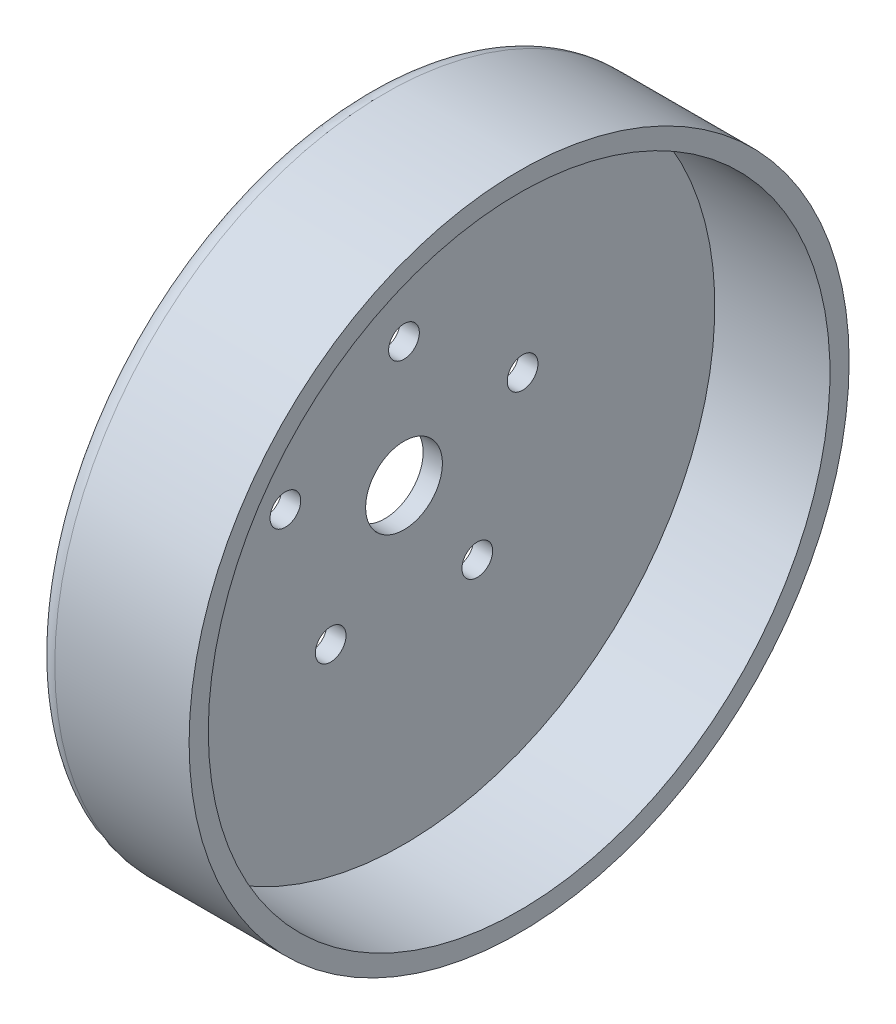
ISO-10303-21;
HEADER;
FILE_DESCRIPTION(('STEP AP214'),'2;1');
FILE_NAME('part.step','',(''),(''),'','','');
FILE_SCHEMA(('AUTOMOTIVE_DESIGN { 1 0 10303 214 1 1 1 1 }'));
ENDSEC;
DATA;
#1=APPLICATION_CONTEXT('core data for automotive mechanical design processes');
#2=APPLICATION_PROTOCOL_DEFINITION('international standard','automotive_design',2000,#1);
#3=PRODUCT_CONTEXT('',#1,'mechanical');
#4=PRODUCT('Part','Part','',(#3));
#5=PRODUCT_RELATED_PRODUCT_CATEGORY('part','',(#4));
#6=PRODUCT_DEFINITION_FORMATION('','',#4);
#7=PRODUCT_DEFINITION_CONTEXT('part definition',#1,'design');
#8=PRODUCT_DEFINITION('design','',#6,#7);
#9=PRODUCT_DEFINITION_SHAPE('','',#8);
#10=(LENGTH_UNIT() NAMED_UNIT(*) SI_UNIT(.MILLI.,.METRE.));
#11=(NAMED_UNIT(*) PLANE_ANGLE_UNIT() SI_UNIT($,.RADIAN.));
#12=(NAMED_UNIT(*) SI_UNIT($,.STERADIAN.) SOLID_ANGLE_UNIT());
#13=UNCERTAINTY_MEASURE_WITH_UNIT(LENGTH_MEASURE(1.E-05),#10,'distance_accuracy_value','');
#14=(GEOMETRIC_REPRESENTATION_CONTEXT(3) GLOBAL_UNCERTAINTY_ASSIGNED_CONTEXT((#13)) GLOBAL_UNIT_ASSIGNED_CONTEXT((#10,
#11,#12)) REPRESENTATION_CONTEXT('',''));
#15=CARTESIAN_POINT('',(0.,0.,0.));
#16=DIRECTION('',(0.,0.,1.));
#17=DIRECTION('',(1.,0.,0.));
#18=AXIS2_PLACEMENT_3D('',#15,#16,#17);
#19=CARTESIAN_POINT('',(0.,0.,0.));
#20=DIRECTION('',(-1.,0.,0.));
#21=DIRECTION('',(0.,0.,1.));
#22=AXIS2_PLACEMENT_3D('',#19,#20,#21);
#23=PLANE('',#22);
#24=CARTESIAN_POINT('',(0.,-26.293052317185,19.1030206995079));
#25=DIRECTION('',(-1.,0.,0.));
#26=DIRECTION('',(0.,0.,1.));
#27=AXIS2_PLACEMENT_3D('',#24,#25,#26);
#28=CIRCLE('',#27,4.00000000000234);
#29=CARTESIAN_POINT('',(0.,-26.293052317185,23.1030206995102));
#30=VERTEX_POINT('',#29);
#31=EDGE_CURVE('E86',#30,#30,#28,.F.);
#32=ORIENTED_EDGE('',*,*,#31,.F.);
#33=EDGE_LOOP('',(#32));
#34=FACE_BOUND('',#33,.T.);
#35=CARTESIAN_POINT('',(0.,10.0430523171871,30.9093367795934));
#36=DIRECTION('',(-1.,0.,0.));
#37=DIRECTION('',(0.,0.,1.));
#38=AXIS2_PLACEMENT_3D('',#35,#36,#37);
#39=CIRCLE('',#38,4.00000000000063);
#40=CARTESIAN_POINT('',(0.,10.0430523171871,34.9093367795941));
#41=VERTEX_POINT('',#40);
#42=EDGE_CURVE('E80',#41,#41,#39,.F.);
#43=ORIENTED_EDGE('',*,*,#42,.F.);
#44=EDGE_LOOP('',(#43));
#45=FACE_BOUND('',#44,.T.);
#46=CARTESIAN_POINT('',(0.,32.5,0.));
#47=DIRECTION('',(-1.,0.,0.));
#48=DIRECTION('',(0.,0.,1.));
#49=AXIS2_PLACEMENT_3D('',#46,#47,#48);
#50=CIRCLE('',#49,4.);
#51=CARTESIAN_POINT('',(0.,32.5,4.));
#52=VERTEX_POINT('',#51);
#53=EDGE_CURVE('E73',#52,#52,#50,.F.);
#54=ORIENTED_EDGE('',*,*,#53,.F.);
#55=EDGE_LOOP('',(#54));
#56=FACE_BOUND('',#55,.T.);
#57=CARTESIAN_POINT('',(0.,10.0430523171845,-30.9093367795915));
#58=DIRECTION('',(-1.,0.,0.));
#59=DIRECTION('',(0.,0.,1.));
#60=AXIS2_PLACEMENT_3D('',#57,#58,#59);
#61=CIRCLE('',#60,4.00000000000166);
#62=CARTESIAN_POINT('',(0.,10.0430523171845,-26.9093367795899));
#63=VERTEX_POINT('',#62);
#64=EDGE_CURVE('E74',#63,#63,#61,.F.);
#65=ORIENTED_EDGE('',*,*,#64,.F.);
#66=EDGE_LOOP('',(#65));
#67=FACE_BOUND('',#66,.T.);
#68=CARTESIAN_POINT('',(0.,-26.2930523171866,-19.1030206995029));
#69=DIRECTION('',(-1.,0.,0.));
#70=DIRECTION('',(0.,0.,1.));
#71=AXIS2_PLACEMENT_3D('',#68,#69,#70);
#72=CIRCLE('',#71,4.0000000000029);
#73=CARTESIAN_POINT('',(0.,-26.2930523171866,-15.1030206995));
#74=VERTEX_POINT('',#73);
#75=EDGE_CURVE('E63',#74,#74,#72,.F.);
#76=ORIENTED_EDGE('',*,*,#75,.F.);
#77=EDGE_LOOP('',(#76));
#78=FACE_BOUND('',#77,.T.);
#79=CARTESIAN_POINT('',(0.,0.,0.));
#80=DIRECTION('',(-1.,0.,0.));
#81=DIRECTION('',(0.,0.,1.));
#82=AXIS2_PLACEMENT_3D('',#79,#80,#81);
#83=CIRCLE('',#82,10.);
#84=CARTESIAN_POINT('',(0.,0.,10.));
#85=VERTEX_POINT('',#84);
#86=EDGE_CURVE('E58',#85,#85,#83,.T.);
#87=ORIENTED_EDGE('',*,*,#86,.T.);
#88=EDGE_LOOP('',(#87));
#89=FACE_BOUND('',#88,.T.);
#90=CARTESIAN_POINT('',(0.,0.,0.));
#91=DIRECTION('',(-1.,0.,0.));
#92=DIRECTION('',(0.,0.,1.));
#93=AXIS2_PLACEMENT_3D('',#90,#91,#92);
#94=CIRCLE('',#93,81.);
#95=CARTESIAN_POINT('',(0.,0.,81.));
#96=VERTEX_POINT('',#95);
#97=EDGE_CURVE('E43',#96,#96,#94,.T.);
#98=ORIENTED_EDGE('',*,*,#97,.F.);
#99=EDGE_LOOP('',(#98));
#100=FACE_BOUND('',#99,.T.);
#101=ADVANCED_FACE('F31',(#34,#45,#56,#67,#78,#89,#100),#23,.F.);
#102=CARTESIAN_POINT('',(-10.,0.,0.));
#103=DIRECTION('',(-1.,0.,0.));
#104=DIRECTION('',(0.,0.,1.));
#105=AXIS2_PLACEMENT_3D('',#102,#103,#104);
#106=CYLINDRICAL_SURFACE('',#105,81.);
#107=CARTESIAN_POINT('',(30.,0.,0.));
#108=DIRECTION('',(-1.,0.,0.));
#109=DIRECTION('',(0.,0.,1.));
#110=AXIS2_PLACEMENT_3D('',#107,#108,#109);
#111=CIRCLE('',#110,81.);
#112=CARTESIAN_POINT('',(30.,0.,81.));
#113=VERTEX_POINT('',#112);
#114=EDGE_CURVE('E48',#113,#113,#111,.T.);
#115=ORIENTED_EDGE('',*,*,#114,.F.);
#116=EDGE_LOOP('',(#115));
#117=FACE_BOUND('',#116,.T.);
#118=ORIENTED_EDGE('',*,*,#97,.T.);
#119=EDGE_LOOP('',(#118));
#120=FACE_BOUND('',#119,.T.);
#121=ADVANCED_FACE('F98',(#117,#120),#106,.F.);
#122=CARTESIAN_POINT('',(30.,81.,0.));
#123=DIRECTION('',(-1.,0.,0.));
#124=DIRECTION('',(0.,0.,1.));
#125=AXIS2_PLACEMENT_3D('',#122,#123,#124);
#126=PLANE('',#125);
#127=CARTESIAN_POINT('',(30.,0.,0.));
#128=DIRECTION('',(-1.,0.,0.));
#129=DIRECTION('',(0.,0.,1.));
#130=AXIS2_PLACEMENT_3D('',#127,#128,#129);
#131=CIRCLE('',#130,86.);
#132=CARTESIAN_POINT('',(30.,0.,86.));
#133=VERTEX_POINT('',#132);
#134=EDGE_CURVE('E51',#133,#133,#131,.T.);
#135=ORIENTED_EDGE('',*,*,#134,.F.);
#136=EDGE_LOOP('',(#135));
#137=FACE_BOUND('',#136,.T.);
#138=ORIENTED_EDGE('',*,*,#114,.T.);
#139=EDGE_LOOP('',(#138));
#140=FACE_BOUND('',#139,.T.);
#141=ADVANCED_FACE('F112',(#137,#140),#126,.F.);
#142=CARTESIAN_POINT('',(-10.,0.,0.));
#143=DIRECTION('',(-1.,0.,0.));
#144=DIRECTION('',(0.,0.,1.));
#145=AXIS2_PLACEMENT_3D('',#142,#143,#144);
#146=CYLINDRICAL_SURFACE('',#145,86.);
#147=CARTESIAN_POINT('',(-5.00000000000001,0.,0.));
#148=DIRECTION('',(1.,0.,0.));
#149=DIRECTION('',(0.,0.,-1.));
#150=AXIS2_PLACEMENT_3D('',#147,#148,#149);
#151=CIRCLE('',#150,86.);
#152=CARTESIAN_POINT('',(-5.00000000000001,0.,-86.));
#153=VERTEX_POINT('',#152);
#154=EDGE_CURVE('E10',#153,#153,#151,.T.);
#155=ORIENTED_EDGE('',*,*,#154,.T.);
#156=EDGE_LOOP('',(#155));
#157=FACE_BOUND('',#156,.T.);
#158=ORIENTED_EDGE('',*,*,#134,.T.);
#159=EDGE_LOOP('',(#158));
#160=FACE_BOUND('',#159,.T.);
#161=ADVANCED_FACE('F119',(#157,#160),#146,.T.);
#162=CARTESIAN_POINT('',(-10.,86.,0.));
#163=DIRECTION('',(1.,0.,0.));
#164=DIRECTION('',(0.,0.,-1.));
#165=AXIS2_PLACEMENT_3D('',#162,#163,#164);
#166=PLANE('',#165);
#167=CARTESIAN_POINT('',(-10.,0.,0.));
#168=DIRECTION('',(-1.,0.,0.));
#169=DIRECTION('',(0.,0.,1.));
#170=AXIS2_PLACEMENT_3D('',#167,#168,#169);
#171=CIRCLE('',#170,45.);
#172=CARTESIAN_POINT('',(-10.,0.,45.));
#173=VERTEX_POINT('',#172);
#174=EDGE_CURVE('E55',#173,#173,#171,.T.);
#175=ORIENTED_EDGE('',*,*,#174,.F.);
#176=EDGE_LOOP('',(#175));
#177=FACE_BOUND('',#176,.T.);
#178=CARTESIAN_POINT('',(-10.,0.,0.));
#179=DIRECTION('',(1.,0.,0.));
#180=DIRECTION('',(0.,0.,-1.));
#181=AXIS2_PLACEMENT_3D('',#178,#179,#180);
#182=CIRCLE('',#181,81.);
#183=CARTESIAN_POINT('',(-10.,0.,-81.));
#184=VERTEX_POINT('',#183);
#185=EDGE_CURVE('E39',#184,#184,#182,.F.);
#186=ORIENTED_EDGE('',*,*,#185,.T.);
#187=EDGE_LOOP('',(#186));
#188=FACE_BOUND('',#187,.T.);
#189=ADVANCED_FACE('F126',(#177,#188),#166,.F.);
#190=CARTESIAN_POINT('',(-5.00000000000001,0.,0.));
#191=DIRECTION('',(1.,0.,0.));
#192=DIRECTION('',(0.,0.,-1.));
#193=AXIS2_PLACEMENT_3D('',#190,#191,#192);
#194=TOROIDAL_SURFACE('',#193,81.,5.);
#195=ORIENTED_EDGE('',*,*,#154,.F.);
#196=EDGE_LOOP('',(#195));
#197=FACE_BOUND('',#196,.T.);
#198=ORIENTED_EDGE('',*,*,#185,.F.);
#199=EDGE_LOOP('',(#198));
#200=FACE_BOUND('',#199,.T.);
#201=ADVANCED_FACE('F33',(#197,#200),#194,.T.);
#202=CARTESIAN_POINT('',(-5.00000000000001,0.,0.));
#203=DIRECTION('',(-1.,0.,0.));
#204=DIRECTION('',(0.,0.,1.));
#205=AXIS2_PLACEMENT_3D('',#202,#203,#204);
#206=CYLINDRICAL_SURFACE('',#205,45.);
#207=CARTESIAN_POINT('',(-5.00000000000001,0.,0.));
#208=DIRECTION('',(-1.,0.,0.));
#209=DIRECTION('',(0.,0.,1.));
#210=AXIS2_PLACEMENT_3D('',#207,#208,#209);
#211=CIRCLE('',#210,45.);
#212=CARTESIAN_POINT('',(-5.00000000000001,0.,45.));
#213=VERTEX_POINT('',#212);
#214=EDGE_CURVE('E54',#213,#213,#211,.T.);
#215=ORIENTED_EDGE('',*,*,#214,.F.);
#216=EDGE_LOOP('',(#215));
#217=FACE_BOUND('',#216,.T.);
#218=ORIENTED_EDGE('',*,*,#174,.T.);
#219=EDGE_LOOP('',(#218));
#220=FACE_BOUND('',#219,.T.);
#221=ADVANCED_FACE('F130',(#217,#220),#206,.F.);
#222=CARTESIAN_POINT('',(-5.00000000000001,0.,0.));
#223=DIRECTION('',(-1.,0.,0.));
#224=DIRECTION('',(0.,0.,1.));
#225=AXIS2_PLACEMENT_3D('',#222,#223,#224);
#226=PLANE('',#225);
#227=CARTESIAN_POINT('',(-5.00000000000001,-26.293052317185,19.1030206995079));
#228=DIRECTION('',(-1.,0.,0.));
#229=DIRECTION('',(0.,0.,1.));
#230=AXIS2_PLACEMENT_3D('',#227,#228,#229);
#231=CIRCLE('',#230,4.00000000000234);
#232=CARTESIAN_POINT('',(-5.00000000000001,-26.293052317185,23.1030206995102));
#233=VERTEX_POINT('',#232);
#234=EDGE_CURVE('E69',#233,#233,#231,.T.);
#235=ORIENTED_EDGE('',*,*,#234,.F.);
#236=EDGE_LOOP('',(#235));
#237=FACE_BOUND('',#236,.T.);
#238=CARTESIAN_POINT('',(-5.00000000000001,10.0430523171871,30.9093367795934));
#239=DIRECTION('',(-1.,0.,0.));
#240=DIRECTION('',(0.,0.,1.));
#241=AXIS2_PLACEMENT_3D('',#238,#239,#240);
#242=CIRCLE('',#241,4.00000000000063);
#243=CARTESIAN_POINT('',(-5.00000000000001,10.0430523171871,34.9093367795941));
#244=VERTEX_POINT('',#243);
#245=EDGE_CURVE('E83',#244,#244,#242,.T.);
#246=ORIENTED_EDGE('',*,*,#245,.F.);
#247=EDGE_LOOP('',(#246));
#248=FACE_BOUND('',#247,.T.);
#249=CARTESIAN_POINT('',(-5.00000000000001,32.5,0.));
#250=DIRECTION('',(-1.,0.,0.));
#251=DIRECTION('',(0.,0.,1.));
#252=AXIS2_PLACEMENT_3D('',#249,#250,#251);
#253=CIRCLE('',#252,4.);
#254=CARTESIAN_POINT('',(-5.00000000000001,32.5,4.));
#255=VERTEX_POINT('',#254);
#256=EDGE_CURVE('E77',#255,#255,#253,.T.);
#257=ORIENTED_EDGE('',*,*,#256,.F.);
#258=EDGE_LOOP('',(#257));
#259=FACE_BOUND('',#258,.T.);
#260=CARTESIAN_POINT('',(-5.00000000000001,10.0430523171845,-30.9093367795915));
#261=DIRECTION('',(-1.,0.,0.));
#262=DIRECTION('',(0.,0.,1.));
#263=AXIS2_PLACEMENT_3D('',#260,#261,#262);
#264=CIRCLE('',#263,4.00000000000166);
#265=CARTESIAN_POINT('',(-5.00000000000001,10.0430523171845,-26.9093367795899));
#266=VERTEX_POINT('',#265);
#267=EDGE_CURVE('E70',#266,#266,#264,.T.);
#268=ORIENTED_EDGE('',*,*,#267,.F.);
#269=EDGE_LOOP('',(#268));
#270=FACE_BOUND('',#269,.T.);
#271=CARTESIAN_POINT('',(-5.00000000000001,-26.2930523171866,-19.1030206995029));
#272=DIRECTION('',(-1.,0.,0.));
#273=DIRECTION('',(0.,0.,1.));
#274=AXIS2_PLACEMENT_3D('',#271,#272,#273);
#275=CIRCLE('',#274,4.0000000000029);
#276=CARTESIAN_POINT('',(-5.00000000000001,-26.2930523171866,-15.1030206995));
#277=VERTEX_POINT('',#276);
#278=EDGE_CURVE('E66',#277,#277,#275,.T.);
#279=ORIENTED_EDGE('',*,*,#278,.F.);
#280=EDGE_LOOP('',(#279));
#281=FACE_BOUND('',#280,.T.);
#282=CARTESIAN_POINT('',(-5.00000000000001,0.,0.));
#283=DIRECTION('',(-1.,0.,0.));
#284=DIRECTION('',(0.,0.,1.));
#285=AXIS2_PLACEMENT_3D('',#282,#283,#284);
#286=CIRCLE('',#285,10.);
#287=CARTESIAN_POINT('',(-5.00000000000001,0.,10.));
#288=VERTEX_POINT('',#287);
#289=EDGE_CURVE('E35',#288,#288,#286,.T.);
#290=ORIENTED_EDGE('',*,*,#289,.F.);
#291=EDGE_LOOP('',(#290));
#292=FACE_BOUND('',#291,.T.);
#293=ORIENTED_EDGE('',*,*,#214,.T.);
#294=EDGE_LOOP('',(#293));
#295=FACE_BOUND('',#294,.T.);
#296=ADVANCED_FACE('F133',(#237,#248,#259,#270,#281,#292,#295),#226,.T.);
#297=CARTESIAN_POINT('',(30.,0.,0.));
#298=DIRECTION('',(-1.,0.,0.));
#299=DIRECTION('',(0.,0.,1.));
#300=AXIS2_PLACEMENT_3D('',#297,#298,#299);
#301=CYLINDRICAL_SURFACE('',#300,10.);
#302=ORIENTED_EDGE('',*,*,#289,.T.);
#303=EDGE_LOOP('',(#302));
#304=FACE_BOUND('',#303,.T.);
#305=ORIENTED_EDGE('',*,*,#86,.F.);
#306=EDGE_LOOP('',(#305));
#307=FACE_BOUND('',#306,.T.);
#308=ADVANCED_FACE('F137',(#304,#307),#301,.F.);
#309=CARTESIAN_POINT('',(30.001,-26.2930523171866,-19.1030206995029));
#310=DIRECTION('',(-1.,0.,0.));
#311=DIRECTION('',(0.,0.,1.));
#312=AXIS2_PLACEMENT_3D('',#309,#310,#311);
#313=CYLINDRICAL_SURFACE('',#312,4.0000000000029);
#314=ORIENTED_EDGE('',*,*,#278,.T.);
#315=EDGE_LOOP('',(#314));
#316=FACE_BOUND('',#315,.T.);
#317=ORIENTED_EDGE('',*,*,#75,.T.);
#318=EDGE_LOOP('',(#317));
#319=FACE_BOUND('',#318,.T.);
#320=ADVANCED_FACE('F141',(#316,#319),#313,.F.);
#321=CARTESIAN_POINT('',(30.001,10.0430523171845,-30.9093367795915));
#322=DIRECTION('',(-1.,0.,0.));
#323=DIRECTION('',(0.,0.,1.));
#324=AXIS2_PLACEMENT_3D('',#321,#322,#323);
#325=CYLINDRICAL_SURFACE('',#324,4.00000000000166);
#326=ORIENTED_EDGE('',*,*,#267,.T.);
#327=EDGE_LOOP('',(#326));
#328=FACE_BOUND('',#327,.T.);
#329=ORIENTED_EDGE('',*,*,#64,.T.);
#330=EDGE_LOOP('',(#329));
#331=FACE_BOUND('',#330,.T.);
#332=ADVANCED_FACE('F145',(#328,#331),#325,.F.);
#333=CARTESIAN_POINT('',(30.001,32.5,0.));
#334=DIRECTION('',(-1.,0.,0.));
#335=DIRECTION('',(0.,0.,1.));
#336=AXIS2_PLACEMENT_3D('',#333,#334,#335);
#337=CYLINDRICAL_SURFACE('',#336,4.);
#338=ORIENTED_EDGE('',*,*,#256,.T.);
#339=EDGE_LOOP('',(#338));
#340=FACE_BOUND('',#339,.T.);
#341=ORIENTED_EDGE('',*,*,#53,.T.);
#342=EDGE_LOOP('',(#341));
#343=FACE_BOUND('',#342,.T.);
#344=ADVANCED_FACE('F149',(#340,#343),#337,.F.);
#345=CARTESIAN_POINT('',(30.001,10.0430523171871,30.9093367795934));
#346=DIRECTION('',(-1.,0.,0.));
#347=DIRECTION('',(0.,0.,1.));
#348=AXIS2_PLACEMENT_3D('',#345,#346,#347);
#349=CYLINDRICAL_SURFACE('',#348,4.00000000000063);
#350=ORIENTED_EDGE('',*,*,#245,.T.);
#351=EDGE_LOOP('',(#350));
#352=FACE_BOUND('',#351,.T.);
#353=ORIENTED_EDGE('',*,*,#42,.T.);
#354=EDGE_LOOP('',(#353));
#355=FACE_BOUND('',#354,.T.);
#356=ADVANCED_FACE('F153',(#352,#355),#349,.F.);
#357=CARTESIAN_POINT('',(30.001,-26.293052317185,19.1030206995079));
#358=DIRECTION('',(-1.,0.,0.));
#359=DIRECTION('',(0.,0.,1.));
#360=AXIS2_PLACEMENT_3D('',#357,#358,#359);
#361=CYLINDRICAL_SURFACE('',#360,4.00000000000234);
#362=ORIENTED_EDGE('',*,*,#234,.T.);
#363=EDGE_LOOP('',(#362));
#364=FACE_BOUND('',#363,.T.);
#365=ORIENTED_EDGE('',*,*,#31,.T.);
#366=EDGE_LOOP('',(#365));
#367=FACE_BOUND('',#366,.T.);
#368=ADVANCED_FACE('F94',(#364,#367),#361,.F.);
#369=CLOSED_SHELL('',(#101,#121,#141,#161,#189,#201,#221,#296,#308,#320,#332,#344,#356,#368));
#370=MANIFOLD_SOLID_BREP('B2',#369);
#371=ADVANCED_BREP_SHAPE_REPRESENTATION('',(#18,#370),#14);
#372=SHAPE_DEFINITION_REPRESENTATION(#9,#371);
ENDSEC;
END-ISO-10303-21;
